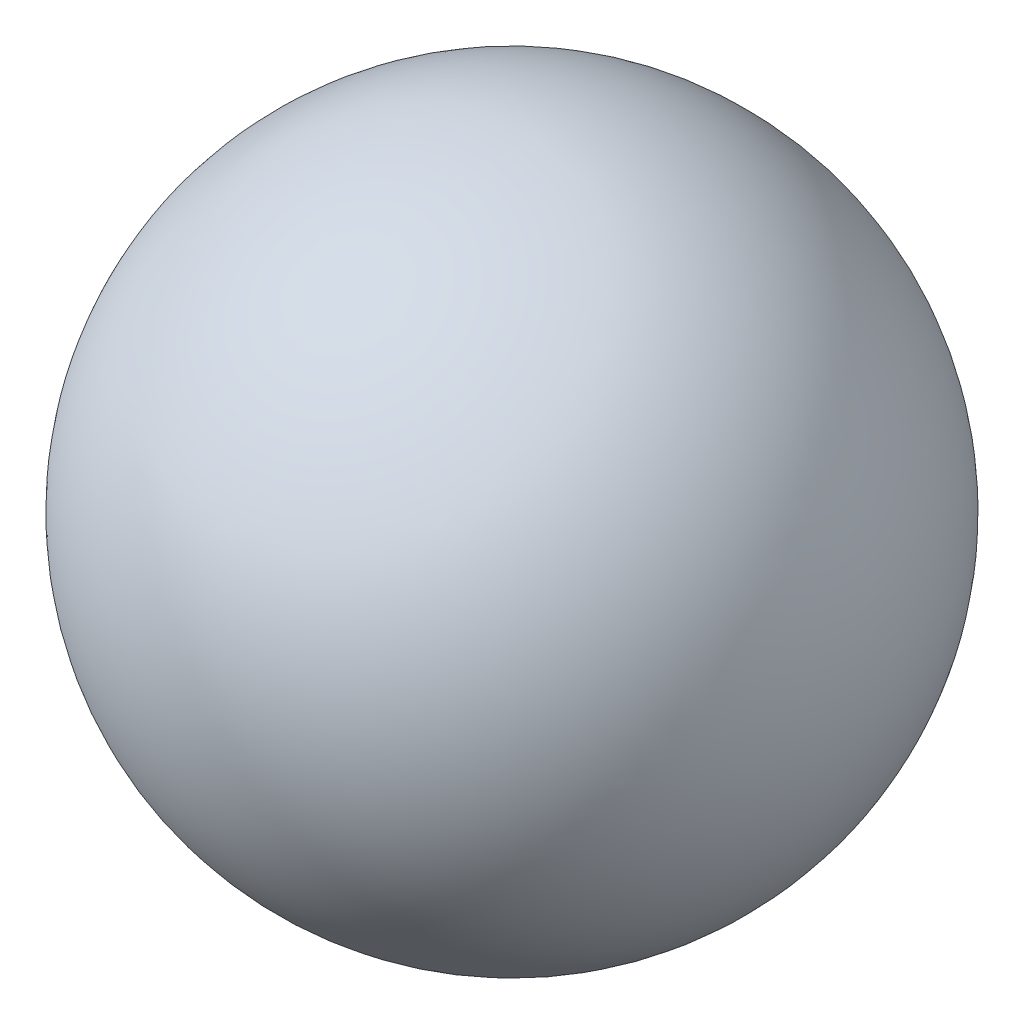
ISO-10303-21;
HEADER;
FILE_DESCRIPTION(('STEP AP214'),'2;1');
FILE_NAME('part.step','',(''),(''),'','','');
FILE_SCHEMA(('AUTOMOTIVE_DESIGN { 1 0 10303 214 1 1 1 1 }'));
ENDSEC;
DATA;
#1=APPLICATION_CONTEXT('core data for automotive mechanical design processes');
#2=APPLICATION_PROTOCOL_DEFINITION('international standard','automotive_design',2000,#1);
#3=PRODUCT_CONTEXT('',#1,'mechanical');
#4=PRODUCT('Part','Part','',(#3));
#5=PRODUCT_RELATED_PRODUCT_CATEGORY('part','',(#4));
#6=PRODUCT_DEFINITION_FORMATION('','',#4);
#7=PRODUCT_DEFINITION_CONTEXT('part definition',#1,'design');
#8=PRODUCT_DEFINITION('design','',#6,#7);
#9=PRODUCT_DEFINITION_SHAPE('','',#8);
#10=(LENGTH_UNIT() NAMED_UNIT(*) SI_UNIT(.MILLI.,.METRE.));
#11=(NAMED_UNIT(*) PLANE_ANGLE_UNIT() SI_UNIT($,.RADIAN.));
#12=(NAMED_UNIT(*) SI_UNIT($,.STERADIAN.) SOLID_ANGLE_UNIT());
#13=UNCERTAINTY_MEASURE_WITH_UNIT(LENGTH_MEASURE(1.E-05),#10,'distance_accuracy_value','');
#14=(GEOMETRIC_REPRESENTATION_CONTEXT(3) GLOBAL_UNCERTAINTY_ASSIGNED_CONTEXT((#13)) GLOBAL_UNIT_ASSIGNED_CONTEXT((#10,
#11,#12)) REPRESENTATION_CONTEXT('',''));
#15=CARTESIAN_POINT('',(0.,0.,0.));
#16=DIRECTION('',(0.,0.,1.));
#17=DIRECTION('',(1.,0.,0.));
#18=AXIS2_PLACEMENT_3D('',#15,#16,#17);
#19=CARTESIAN_POINT('',(0.,0.,0.));
#20=DIRECTION('',(-1.,0.,0.));
#21=DIRECTION('',(0.,1.,0.));
#22=AXIS2_PLACEMENT_3D('',#19,#20,#21);
#23=SPHERICAL_SURFACE('',#22,1.05);
#24=CARTESIAN_POINT('',(-1.05,0.,0.));
#25=VERTEX_POINT('',#24);
#26=VERTEX_LOOP('',#25);
#27=FACE_BOUND('',#26,.T.);
#28=ADVANCED_FACE('F27',(#27),#23,.T.);
#29=CLOSED_SHELL('',(#28));
#30=MANIFOLD_SOLID_BREP('B2',#29);
#31=ADVANCED_BREP_SHAPE_REPRESENTATION('',(#18,#30),#14);
#32=SHAPE_DEFINITION_REPRESENTATION(#9,#31);
ENDSEC;
END-ISO-10303-21;
